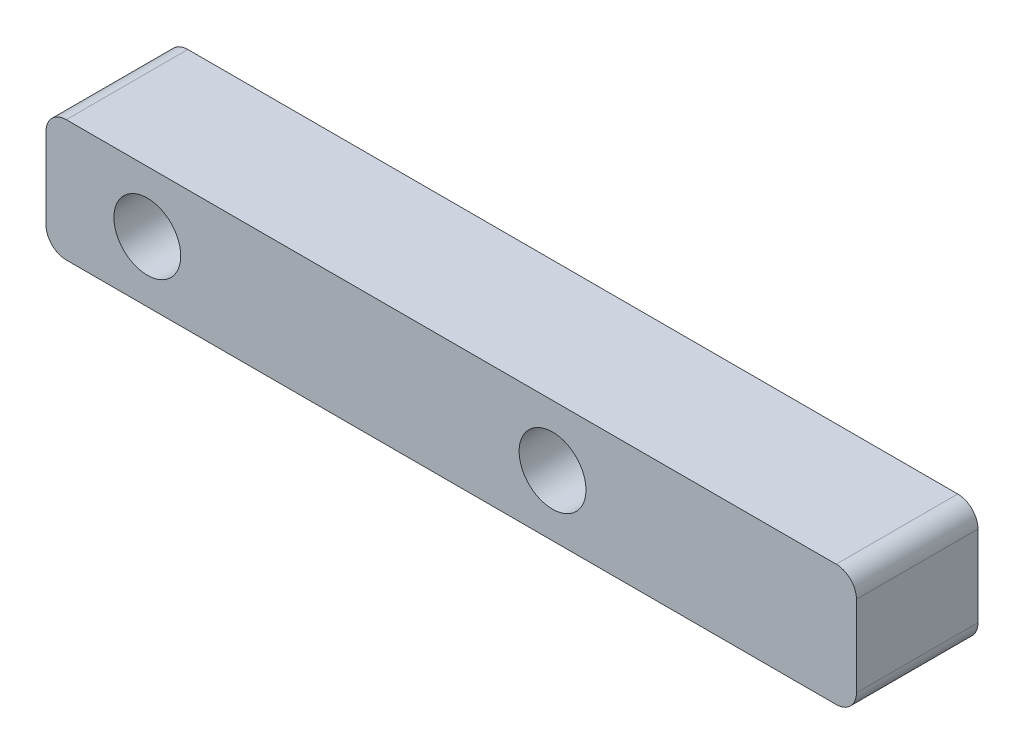
ISO-10303-21;
HEADER;
FILE_DESCRIPTION(('STEP AP214'),'2;1');
FILE_NAME('part.step','',(''),(''),'','','');
FILE_SCHEMA(('AUTOMOTIVE_DESIGN { 1 0 10303 214 1 1 1 1 }'));
ENDSEC;
DATA;
#1=APPLICATION_CONTEXT('core data for automotive mechanical design processes');
#2=APPLICATION_PROTOCOL_DEFINITION('international standard','automotive_design',2000,#1);
#3=PRODUCT_CONTEXT('',#1,'mechanical');
#4=PRODUCT('Part','Part','',(#3));
#5=PRODUCT_RELATED_PRODUCT_CATEGORY('part','',(#4));
#6=PRODUCT_DEFINITION_FORMATION('','',#4);
#7=PRODUCT_DEFINITION_CONTEXT('part definition',#1,'design');
#8=PRODUCT_DEFINITION('design','',#6,#7);
#9=PRODUCT_DEFINITION_SHAPE('','',#8);
#10=(LENGTH_UNIT() NAMED_UNIT(*) SI_UNIT(.MILLI.,.METRE.));
#11=(NAMED_UNIT(*) PLANE_ANGLE_UNIT() SI_UNIT($,.RADIAN.));
#12=(NAMED_UNIT(*) SI_UNIT($,.STERADIAN.) SOLID_ANGLE_UNIT());
#13=UNCERTAINTY_MEASURE_WITH_UNIT(LENGTH_MEASURE(1.E-05),#10,'distance_accuracy_value','');
#14=(GEOMETRIC_REPRESENTATION_CONTEXT(3) GLOBAL_UNCERTAINTY_ASSIGNED_CONTEXT((#13)) GLOBAL_UNIT_ASSIGNED_CONTEXT((#10,
#11,#12)) REPRESENTATION_CONTEXT('',''));
#15=CARTESIAN_POINT('',(0.,0.,0.));
#16=DIRECTION('',(0.,0.,1.));
#17=DIRECTION('',(1.,0.,0.));
#18=AXIS2_PLACEMENT_3D('',#15,#16,#17);
#19=CARTESIAN_POINT('',(20.,-3.,6.));
#20=DIRECTION('',(-1.,0.,0.));
#21=DIRECTION('',(0.,0.,1.));
#22=AXIS2_PLACEMENT_3D('',#19,#20,#21);
#23=PLANE('',#22);
#24=DIRECTION('',(0.,1.,0.));
#25=VECTOR('',#24,1.);
#26=CARTESIAN_POINT('',(20.,-3.,6.));
#27=LINE('',#26,#25);
#28=CARTESIAN_POINT('',(20.,-2.,6.));
#29=VERTEX_POINT('',#28);
#30=CARTESIAN_POINT('',(20.,2.,6.));
#31=VERTEX_POINT('',#30);
#32=EDGE_CURVE('E120',#29,#31,#27,.T.);
#33=ORIENTED_EDGE('',*,*,#32,.F.);
#34=DIRECTION('',(0.,0.,-1.));
#35=VECTOR('',#34,1.);
#36=CARTESIAN_POINT('',(20.,-2.,6.));
#37=LINE('',#36,#35);
#38=CARTESIAN_POINT('',(20.,-2.,0.));
#39=VERTEX_POINT('',#38);
#40=EDGE_CURVE('E105',#29,#39,#37,.T.);
#41=ORIENTED_EDGE('',*,*,#40,.T.);
#42=DIRECTION('',(0.,1.,0.));
#43=VECTOR('',#42,1.);
#44=CARTESIAN_POINT('',(20.,-3.,0.));
#45=LINE('',#44,#43);
#46=CARTESIAN_POINT('',(20.,2.,0.));
#47=VERTEX_POINT('',#46);
#48=EDGE_CURVE('E117',#39,#47,#45,.T.);
#49=ORIENTED_EDGE('',*,*,#48,.T.);
#50=DIRECTION('',(0.,0.,-1.));
#51=VECTOR('',#50,1.);
#52=CARTESIAN_POINT('',(20.,2.,6.));
#53=LINE('',#52,#51);
#54=EDGE_CURVE('E122',#47,#31,#53,.F.);
#55=ORIENTED_EDGE('',*,*,#54,.T.);
#56=EDGE_LOOP('',(#33,#41,#49,#55));
#57=FACE_BOUND('',#56,.T.);
#58=ADVANCED_FACE('F34',(#57),#23,.F.);
#59=CARTESIAN_POINT('',(-20.,3.,6.));
#60=DIRECTION('',(0.,-1.,0.));
#61=DIRECTION('',(0.,0.,-1.));
#62=AXIS2_PLACEMENT_3D('',#59,#60,#61);
#63=PLANE('',#62);
#64=DIRECTION('',(-1.,0.,0.));
#65=VECTOR('',#64,1.);
#66=CARTESIAN_POINT('',(-20.,3.,6.));
#67=LINE('',#66,#65);
#68=CARTESIAN_POINT('',(19.,3.,6.));
#69=VERTEX_POINT('',#68);
#70=CARTESIAN_POINT('',(-19.,3.,6.));
#71=VERTEX_POINT('',#70);
#72=EDGE_CURVE('E164',#69,#71,#67,.T.);
#73=ORIENTED_EDGE('',*,*,#72,.F.);
#74=DIRECTION('',(0.,0.,-1.));
#75=VECTOR('',#74,1.);
#76=CARTESIAN_POINT('',(19.,3.,6.));
#77=LINE('',#76,#75);
#78=CARTESIAN_POINT('',(19.,3.,0.));
#79=VERTEX_POINT('',#78);
#80=EDGE_CURVE('E11',#69,#79,#77,.T.);
#81=ORIENTED_EDGE('',*,*,#80,.T.);
#82=DIRECTION('',(-1.,0.,0.));
#83=VECTOR('',#82,1.);
#84=CARTESIAN_POINT('',(-20.,3.,0.));
#85=LINE('',#84,#83);
#86=CARTESIAN_POINT('',(-19.,3.,0.));
#87=VERTEX_POINT('',#86);
#88=EDGE_CURVE('E127',#79,#87,#85,.T.);
#89=ORIENTED_EDGE('',*,*,#88,.T.);
#90=DIRECTION('',(0.,0.,-1.));
#91=VECTOR('',#90,1.);
#92=CARTESIAN_POINT('',(-19.,3.,6.));
#93=LINE('',#92,#91);
#94=EDGE_CURVE('E42',#87,#71,#93,.F.);
#95=ORIENTED_EDGE('',*,*,#94,.T.);
#96=EDGE_LOOP('',(#73,#81,#89,#95));
#97=FACE_BOUND('',#96,.T.);
#98=ADVANCED_FACE('F163',(#97),#63,.F.);
#99=CARTESIAN_POINT('',(-20.,-3.,6.));
#100=DIRECTION('',(1.,0.,0.));
#101=DIRECTION('',(0.,0.,-1.));
#102=AXIS2_PLACEMENT_3D('',#99,#100,#101);
#103=PLANE('',#102);
#104=DIRECTION('',(0.,-1.,0.));
#105=VECTOR('',#104,1.);
#106=CARTESIAN_POINT('',(-20.,-3.,0.));
#107=LINE('',#106,#105);
#108=CARTESIAN_POINT('',(-20.,2.,0.));
#109=VERTEX_POINT('',#108);
#110=CARTESIAN_POINT('',(-20.,-2.,0.));
#111=VERTEX_POINT('',#110);
#112=EDGE_CURVE('E131',#109,#111,#107,.T.);
#113=ORIENTED_EDGE('',*,*,#112,.T.);
#114=DIRECTION('',(0.,0.,-1.));
#115=VECTOR('',#114,1.);
#116=CARTESIAN_POINT('',(-20.,-2.,6.));
#117=LINE('',#116,#115);
#118=CARTESIAN_POINT('',(-20.,-2.,6.));
#119=VERTEX_POINT('',#118);
#120=EDGE_CURVE('E49',#111,#119,#117,.F.);
#121=ORIENTED_EDGE('',*,*,#120,.T.);
#122=DIRECTION('',(0.,-1.,0.));
#123=VECTOR('',#122,1.);
#124=CARTESIAN_POINT('',(-20.,-3.,6.));
#125=LINE('',#124,#123);
#126=CARTESIAN_POINT('',(-20.,2.,6.));
#127=VERTEX_POINT('',#126);
#128=EDGE_CURVE('E170',#127,#119,#125,.T.);
#129=ORIENTED_EDGE('',*,*,#128,.F.);
#130=DIRECTION('',(0.,0.,-1.));
#131=VECTOR('',#130,1.);
#132=CARTESIAN_POINT('',(-20.,2.,6.));
#133=LINE('',#132,#131);
#134=EDGE_CURVE('E157',#127,#109,#133,.T.);
#135=ORIENTED_EDGE('',*,*,#134,.T.);
#136=EDGE_LOOP('',(#113,#121,#129,#135));
#137=FACE_BOUND('',#136,.T.);
#138=ADVANCED_FACE('F174',(#137),#103,.F.);
#139=CARTESIAN_POINT('',(-20.,-3.,6.));
#140=DIRECTION('',(0.,1.,0.));
#141=DIRECTION('',(0.,0.,1.));
#142=AXIS2_PLACEMENT_3D('',#139,#140,#141);
#143=PLANE('',#142);
#144=DIRECTION('',(1.,0.,0.));
#145=VECTOR('',#144,1.);
#146=CARTESIAN_POINT('',(-20.,-3.,0.));
#147=LINE('',#146,#145);
#148=CARTESIAN_POINT('',(-19.,-3.,0.));
#149=VERTEX_POINT('',#148);
#150=CARTESIAN_POINT('',(19.,-3.,0.));
#151=VERTEX_POINT('',#150);
#152=EDGE_CURVE('E141',#149,#151,#147,.T.);
#153=ORIENTED_EDGE('',*,*,#152,.T.);
#154=DIRECTION('',(0.,0.,-1.));
#155=VECTOR('',#154,1.);
#156=CARTESIAN_POINT('',(19.,-3.,6.));
#157=LINE('',#156,#155);
#158=CARTESIAN_POINT('',(19.,-3.,6.));
#159=VERTEX_POINT('',#158);
#160=EDGE_CURVE('E106',#151,#159,#157,.F.);
#161=ORIENTED_EDGE('',*,*,#160,.T.);
#162=DIRECTION('',(1.,0.,0.));
#163=VECTOR('',#162,1.);
#164=CARTESIAN_POINT('',(-20.,-3.,6.));
#165=LINE('',#164,#163);
#166=CARTESIAN_POINT('',(-19.,-3.,6.));
#167=VERTEX_POINT('',#166);
#168=EDGE_CURVE('E137',#167,#159,#165,.T.);
#169=ORIENTED_EDGE('',*,*,#168,.F.);
#170=DIRECTION('',(0.,0.,-1.));
#171=VECTOR('',#170,1.);
#172=CARTESIAN_POINT('',(-19.,-3.,6.));
#173=LINE('',#172,#171);
#174=EDGE_CURVE('E111',#167,#149,#173,.T.);
#175=ORIENTED_EDGE('',*,*,#174,.T.);
#176=EDGE_LOOP('',(#153,#161,#169,#175));
#177=FACE_BOUND('',#176,.T.);
#178=ADVANCED_FACE('F181',(#177),#143,.F.);
#179=CARTESIAN_POINT('',(0.,0.,6.));
#180=DIRECTION('',(0.,0.,-1.));
#181=DIRECTION('',(-1.,0.,0.));
#182=AXIS2_PLACEMENT_3D('',#179,#180,#181);
#183=PLANE('',#182);
#184=CARTESIAN_POINT('',(5.00000000000001,0.,6.));
#185=DIRECTION('',(0.,0.,1.));
#186=DIRECTION('',(1.,0.,0.));
#187=AXIS2_PLACEMENT_3D('',#184,#185,#186);
#188=CIRCLE('',#187,1.65);
#189=CARTESIAN_POINT('',(6.65000000000001,0.,6.));
#190=VERTEX_POINT('',#189);
#191=EDGE_CURVE('E134',#190,#190,#188,.T.);
#192=ORIENTED_EDGE('',*,*,#191,.F.);
#193=EDGE_LOOP('',(#192));
#194=FACE_BOUND('',#193,.T.);
#195=CARTESIAN_POINT('',(-15.,0.,6.));
#196=DIRECTION('',(0.,0.,1.));
#197=DIRECTION('',(1.,0.,0.));
#198=AXIS2_PLACEMENT_3D('',#195,#196,#197);
#199=CIRCLE('',#198,1.65);
#200=CARTESIAN_POINT('',(-13.35,0.,6.));
#201=VERTEX_POINT('',#200);
#202=EDGE_CURVE('E184',#201,#201,#199,.T.);
#203=ORIENTED_EDGE('',*,*,#202,.F.);
#204=EDGE_LOOP('',(#203));
#205=FACE_BOUND('',#204,.T.);
#206=ORIENTED_EDGE('',*,*,#168,.T.);
#207=CARTESIAN_POINT('',(19.,-2.,6.));
#208=DIRECTION('',(0.,0.,-1.));
#209=DIRECTION('',(-1.,0.,0.));
#210=AXIS2_PLACEMENT_3D('',#207,#208,#209);
#211=CIRCLE('',#210,1.);
#212=EDGE_CURVE('E155',#159,#29,#211,.F.);
#213=ORIENTED_EDGE('',*,*,#212,.T.);
#214=ORIENTED_EDGE('',*,*,#32,.T.);
#215=CARTESIAN_POINT('',(19.,2.,6.));
#216=DIRECTION('',(0.,0.,-1.));
#217=DIRECTION('',(-1.,0.,0.));
#218=AXIS2_PLACEMENT_3D('',#215,#216,#217);
#219=CIRCLE('',#218,1.);
#220=EDGE_CURVE('E151',#31,#69,#219,.F.);
#221=ORIENTED_EDGE('',*,*,#220,.T.);
#222=ORIENTED_EDGE('',*,*,#72,.T.);
#223=CARTESIAN_POINT('',(-19.,2.,6.));
#224=DIRECTION('',(0.,0.,-1.));
#225=DIRECTION('',(-1.,0.,0.));
#226=AXIS2_PLACEMENT_3D('',#223,#224,#225);
#227=CIRCLE('',#226,1.);
#228=EDGE_CURVE('E56',#71,#127,#227,.F.);
#229=ORIENTED_EDGE('',*,*,#228,.T.);
#230=ORIENTED_EDGE('',*,*,#128,.T.);
#231=CARTESIAN_POINT('',(-19.,-2.,6.));
#232=DIRECTION('',(0.,0.,-1.));
#233=DIRECTION('',(-1.,0.,0.));
#234=AXIS2_PLACEMENT_3D('',#231,#232,#233);
#235=CIRCLE('',#234,1.);
#236=EDGE_CURVE('E153',#119,#167,#235,.F.);
#237=ORIENTED_EDGE('',*,*,#236,.T.);
#238=EDGE_LOOP('',(#206,#213,#214,#221,#222,#229,#230,#237));
#239=FACE_BOUND('',#238,.T.);
#240=ADVANCED_FACE('F168',(#194,#205,#239),#183,.F.);
#241=CARTESIAN_POINT('',(0.,0.,0.));
#242=DIRECTION('',(0.,0.,-1.));
#243=DIRECTION('',(-1.,0.,0.));
#244=AXIS2_PLACEMENT_3D('',#241,#242,#243);
#245=PLANE('',#244);
#246=CARTESIAN_POINT('',(5.00000000000001,0.,0.));
#247=DIRECTION('',(0.,0.,1.));
#248=DIRECTION('',(1.,0.,0.));
#249=AXIS2_PLACEMENT_3D('',#246,#247,#248);
#250=CIRCLE('',#249,1.65);
#251=CARTESIAN_POINT('',(6.65000000000001,0.,0.));
#252=VERTEX_POINT('',#251);
#253=EDGE_CURVE('E128',#252,#252,#250,.T.);
#254=ORIENTED_EDGE('',*,*,#253,.T.);
#255=EDGE_LOOP('',(#254));
#256=FACE_BOUND('',#255,.T.);
#257=CARTESIAN_POINT('',(-15.,0.,0.));
#258=DIRECTION('',(0.,0.,1.));
#259=DIRECTION('',(1.,0.,0.));
#260=AXIS2_PLACEMENT_3D('',#257,#258,#259);
#261=CIRCLE('',#260,1.65);
#262=CARTESIAN_POINT('',(-13.35,0.,0.));
#263=VERTEX_POINT('',#262);
#264=EDGE_CURVE('E187',#263,#263,#261,.T.);
#265=ORIENTED_EDGE('',*,*,#264,.T.);
#266=EDGE_LOOP('',(#265));
#267=FACE_BOUND('',#266,.T.);
#268=ORIENTED_EDGE('',*,*,#48,.F.);
#269=CARTESIAN_POINT('',(19.,-2.,0.));
#270=DIRECTION('',(0.,0.,-1.));
#271=DIRECTION('',(-1.,0.,0.));
#272=AXIS2_PLACEMENT_3D('',#269,#270,#271);
#273=CIRCLE('',#272,1.);
#274=EDGE_CURVE('E101',#39,#151,#273,.T.);
#275=ORIENTED_EDGE('',*,*,#274,.T.);
#276=ORIENTED_EDGE('',*,*,#152,.F.);
#277=CARTESIAN_POINT('',(-19.,-2.,0.));
#278=DIRECTION('',(0.,0.,-1.));
#279=DIRECTION('',(-1.,0.,0.));
#280=AXIS2_PLACEMENT_3D('',#277,#278,#279);
#281=CIRCLE('',#280,1.);
#282=EDGE_CURVE('E112',#149,#111,#281,.T.);
#283=ORIENTED_EDGE('',*,*,#282,.T.);
#284=ORIENTED_EDGE('',*,*,#112,.F.);
#285=CARTESIAN_POINT('',(-19.,2.,0.));
#286=DIRECTION('',(0.,0.,-1.));
#287=DIRECTION('',(-1.,0.,0.));
#288=AXIS2_PLACEMENT_3D('',#285,#286,#287);
#289=CIRCLE('',#288,1.);
#290=EDGE_CURVE('E121',#109,#87,#289,.T.);
#291=ORIENTED_EDGE('',*,*,#290,.T.);
#292=ORIENTED_EDGE('',*,*,#88,.F.);
#293=CARTESIAN_POINT('',(19.,2.,0.));
#294=DIRECTION('',(0.,0.,-1.));
#295=DIRECTION('',(-1.,0.,0.));
#296=AXIS2_PLACEMENT_3D('',#293,#294,#295);
#297=CIRCLE('',#296,1.);
#298=EDGE_CURVE('E126',#79,#47,#297,.T.);
#299=ORIENTED_EDGE('',*,*,#298,.T.);
#300=EDGE_LOOP('',(#268,#275,#276,#283,#284,#291,#292,#299));
#301=FACE_BOUND('',#300,.T.);
#302=ADVANCED_FACE('F124',(#256,#267,#301),#245,.T.);
#303=CARTESIAN_POINT('',(-15.,0.,0.));
#304=DIRECTION('',(0.,0.,1.));
#305=DIRECTION('',(1.,0.,0.));
#306=AXIS2_PLACEMENT_3D('',#303,#304,#305);
#307=CYLINDRICAL_SURFACE('',#306,1.65);
#308=ORIENTED_EDGE('',*,*,#264,.F.);
#309=EDGE_LOOP('',(#308));
#310=FACE_BOUND('',#309,.T.);
#311=ORIENTED_EDGE('',*,*,#202,.T.);
#312=EDGE_LOOP('',(#311));
#313=FACE_BOUND('',#312,.T.);
#314=ADVANCED_FACE('F200',(#310,#313),#307,.F.);
#315=CARTESIAN_POINT('',(5.00000000000001,0.,0.));
#316=DIRECTION('',(0.,0.,1.));
#317=DIRECTION('',(1.,0.,0.));
#318=AXIS2_PLACEMENT_3D('',#315,#316,#317);
#319=CYLINDRICAL_SURFACE('',#318,1.65);
#320=ORIENTED_EDGE('',*,*,#253,.F.);
#321=EDGE_LOOP('',(#320));
#322=FACE_BOUND('',#321,.T.);
#323=ORIENTED_EDGE('',*,*,#191,.T.);
#324=EDGE_LOOP('',(#323));
#325=FACE_BOUND('',#324,.T.);
#326=ADVANCED_FACE('F193',(#322,#325),#319,.F.);
#327=CARTESIAN_POINT('',(19.,-2.,6.));
#328=DIRECTION('',(0.,0.,-1.));
#329=DIRECTION('',(-1.,0.,0.));
#330=AXIS2_PLACEMENT_3D('',#327,#328,#329);
#331=CYLINDRICAL_SURFACE('',#330,1.);
#332=ORIENTED_EDGE('',*,*,#212,.F.);
#333=ORIENTED_EDGE('',*,*,#160,.F.);
#334=ORIENTED_EDGE('',*,*,#274,.F.);
#335=ORIENTED_EDGE('',*,*,#40,.F.);
#336=EDGE_LOOP('',(#332,#333,#334,#335));
#337=FACE_BOUND('',#336,.T.);
#338=ADVANCED_FACE('F104',(#337),#331,.T.);
#339=CARTESIAN_POINT('',(-19.,-2.,6.));
#340=DIRECTION('',(0.,0.,-1.));
#341=DIRECTION('',(-1.,0.,0.));
#342=AXIS2_PLACEMENT_3D('',#339,#340,#341);
#343=CYLINDRICAL_SURFACE('',#342,1.);
#344=ORIENTED_EDGE('',*,*,#236,.F.);
#345=ORIENTED_EDGE('',*,*,#120,.F.);
#346=ORIENTED_EDGE('',*,*,#282,.F.);
#347=ORIENTED_EDGE('',*,*,#174,.F.);
#348=EDGE_LOOP('',(#344,#345,#346,#347));
#349=FACE_BOUND('',#348,.T.);
#350=ADVANCED_FACE('F178',(#349),#343,.T.);
#351=CARTESIAN_POINT('',(19.,2.,6.));
#352=DIRECTION('',(0.,0.,-1.));
#353=DIRECTION('',(-1.,0.,0.));
#354=AXIS2_PLACEMENT_3D('',#351,#352,#353);
#355=CYLINDRICAL_SURFACE('',#354,1.);
#356=ORIENTED_EDGE('',*,*,#220,.F.);
#357=ORIENTED_EDGE('',*,*,#54,.F.);
#358=ORIENTED_EDGE('',*,*,#298,.F.);
#359=ORIENTED_EDGE('',*,*,#80,.F.);
#360=EDGE_LOOP('',(#356,#357,#358,#359));
#361=FACE_BOUND('',#360,.T.);
#362=ADVANCED_FACE('F224',(#361),#355,.T.);
#363=CARTESIAN_POINT('',(-19.,2.,6.));
#364=DIRECTION('',(0.,0.,-1.));
#365=DIRECTION('',(-1.,0.,0.));
#366=AXIS2_PLACEMENT_3D('',#363,#364,#365);
#367=CYLINDRICAL_SURFACE('',#366,1.);
#368=ORIENTED_EDGE('',*,*,#228,.F.);
#369=ORIENTED_EDGE('',*,*,#94,.F.);
#370=ORIENTED_EDGE('',*,*,#290,.F.);
#371=ORIENTED_EDGE('',*,*,#134,.F.);
#372=EDGE_LOOP('',(#368,#369,#370,#371));
#373=FACE_BOUND('',#372,.T.);
#374=ADVANCED_FACE('F36',(#373),#367,.T.);
#375=CLOSED_SHELL('',(#58,#98,#138,#178,#240,#302,#314,#326,#338,#350,#362,#374));
#376=MANIFOLD_SOLID_BREP('B2',#375);
#377=ADVANCED_BREP_SHAPE_REPRESENTATION('',(#18,#376),#14);
#378=SHAPE_DEFINITION_REPRESENTATION(#9,#377);
ENDSEC;
END-ISO-10303-21;
